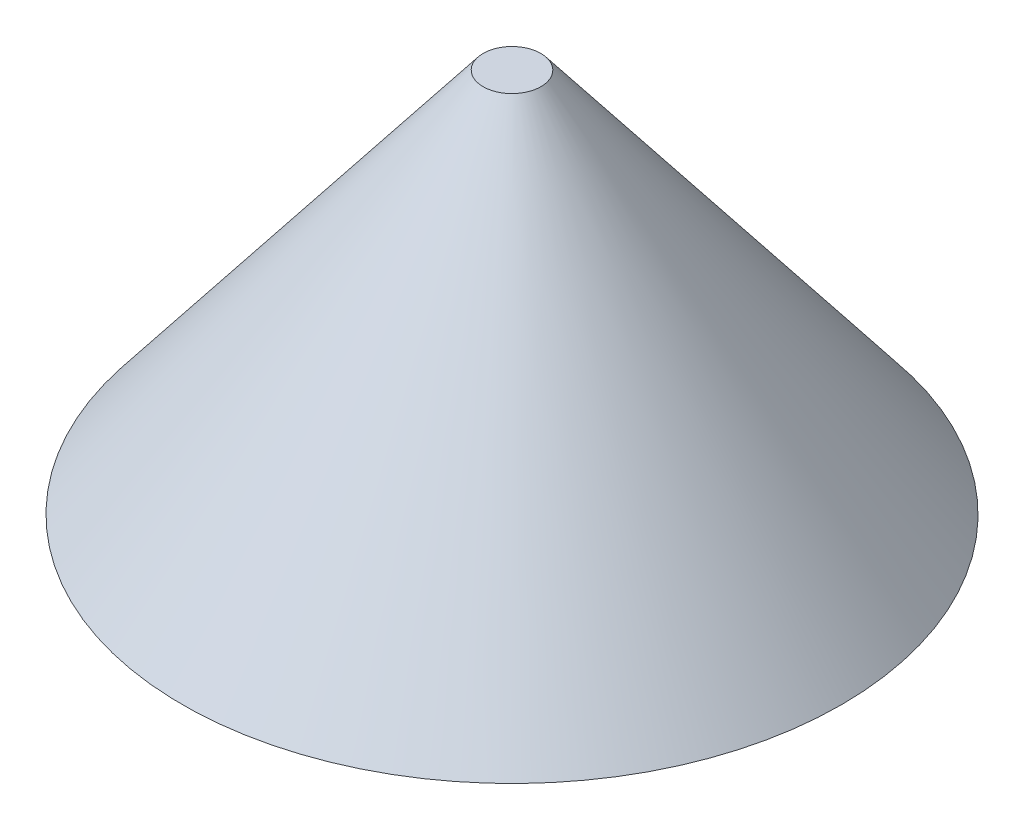
ISO-10303-21;
HEADER;
FILE_DESCRIPTION(('STEP AP214'),'2;1');
FILE_NAME('part.step','',(''),(''),'','','');
FILE_SCHEMA(('AUTOMOTIVE_DESIGN { 1 0 10303 214 1 1 1 1 }'));
ENDSEC;
DATA;
#1=APPLICATION_CONTEXT('core data for automotive mechanical design processes');
#2=APPLICATION_PROTOCOL_DEFINITION('international standard','automotive_design',2000,#1);
#3=PRODUCT_CONTEXT('',#1,'mechanical');
#4=PRODUCT('Part','Part','',(#3));
#5=PRODUCT_RELATED_PRODUCT_CATEGORY('part','',(#4));
#6=PRODUCT_DEFINITION_FORMATION('','',#4);
#7=PRODUCT_DEFINITION_CONTEXT('part definition',#1,'design');
#8=PRODUCT_DEFINITION('design','',#6,#7);
#9=PRODUCT_DEFINITION_SHAPE('','',#8);
#10=(LENGTH_UNIT() NAMED_UNIT(*) SI_UNIT(.MILLI.,.METRE.));
#11=(NAMED_UNIT(*) PLANE_ANGLE_UNIT() SI_UNIT($,.RADIAN.));
#12=(NAMED_UNIT(*) SI_UNIT($,.STERADIAN.) SOLID_ANGLE_UNIT());
#13=UNCERTAINTY_MEASURE_WITH_UNIT(LENGTH_MEASURE(1.E-05),#10,'distance_accuracy_value','');
#14=(GEOMETRIC_REPRESENTATION_CONTEXT(3) GLOBAL_UNCERTAINTY_ASSIGNED_CONTEXT((#13)) GLOBAL_UNIT_ASSIGNED_CONTEXT((#10,
#11,#12)) REPRESENTATION_CONTEXT('',''));
#15=CARTESIAN_POINT('',(0.,0.,0.));
#16=DIRECTION('',(0.,0.,1.));
#17=DIRECTION('',(1.,0.,0.));
#18=AXIS2_PLACEMENT_3D('',#15,#16,#17);
#19=CARTESIAN_POINT('',(-4.5,0.,0.));
#20=DIRECTION('',(0.,1.,0.));
#21=DIRECTION('',(-1.,0.,0.));
#22=AXIS2_PLACEMENT_3D('',#19,#20,#21);
#23=PLANE('',#22);
#24=CARTESIAN_POINT('',(0.,0.,0.));
#25=DIRECTION('',(0.,1.,0.));
#26=DIRECTION('',(-1.,0.,0.));
#27=AXIS2_PLACEMENT_3D('',#24,#25,#26);
#28=CIRCLE('',#27,4.5);
#29=CARTESIAN_POINT('',(-4.5,0.,0.));
#30=VERTEX_POINT('',#29);
#31=EDGE_CURVE('E44',#30,#30,#28,.T.);
#32=ORIENTED_EDGE('',*,*,#31,.T.);
#33=EDGE_LOOP('',(#32));
#34=FACE_BOUND('',#33,.T.);
#35=ADVANCED_FACE('F37',(#34),#23,.T.);
#36=CARTESIAN_POINT('',(0.,-60.,0.));
#37=DIRECTION('',(0.,-1.,0.));
#38=DIRECTION('',(1.,0.,0.));
#39=AXIS2_PLACEMENT_3D('',#36,#37,#38);
#40=PLANE('',#39);
#41=CARTESIAN_POINT('',(0.,-60.,0.));
#42=DIRECTION('',(0.,1.,0.));
#43=DIRECTION('',(-1.,0.,0.));
#44=AXIS2_PLACEMENT_3D('',#41,#42,#43);
#45=CIRCLE('',#44,51.3771375904025);
#46=CARTESIAN_POINT('',(-51.3771375904025,-60.,0.));
#47=VERTEX_POINT('',#46);
#48=EDGE_CURVE('E10',#47,#47,#45,.T.);
#49=ORIENTED_EDGE('',*,*,#48,.F.);
#50=EDGE_LOOP('',(#49));
#51=FACE_BOUND('',#50,.T.);
#52=ADVANCED_FACE('F54',(#51),#40,.T.);
#53=CARTESIAN_POINT('',(0.,0.,0.));
#54=DIRECTION('',(0.,-1.,0.));
#55=DIRECTION('',(1.,0.,0.));
#56=AXIS2_PLACEMENT_3D('',#53,#54,#55);
#57=CONICAL_SURFACE('',#56,4.5,0.663225115757839);
#58=ORIENTED_EDGE('',*,*,#48,.T.);
#59=EDGE_LOOP('',(#58));
#60=FACE_BOUND('',#59,.T.);
#61=ORIENTED_EDGE('',*,*,#31,.F.);
#62=EDGE_LOOP('',(#61));
#63=FACE_BOUND('',#62,.T.);
#64=ADVANCED_FACE('F52',(#60,#63),#57,.T.);
#65=CLOSED_SHELL('',(#35,#52,#64));
#66=MANIFOLD_SOLID_BREP('B2',#65);
#67=ADVANCED_BREP_SHAPE_REPRESENTATION('',(#18,#66),#14);
#68=SHAPE_DEFINITION_REPRESENTATION(#9,#67);
ENDSEC;
END-ISO-10303-21;
